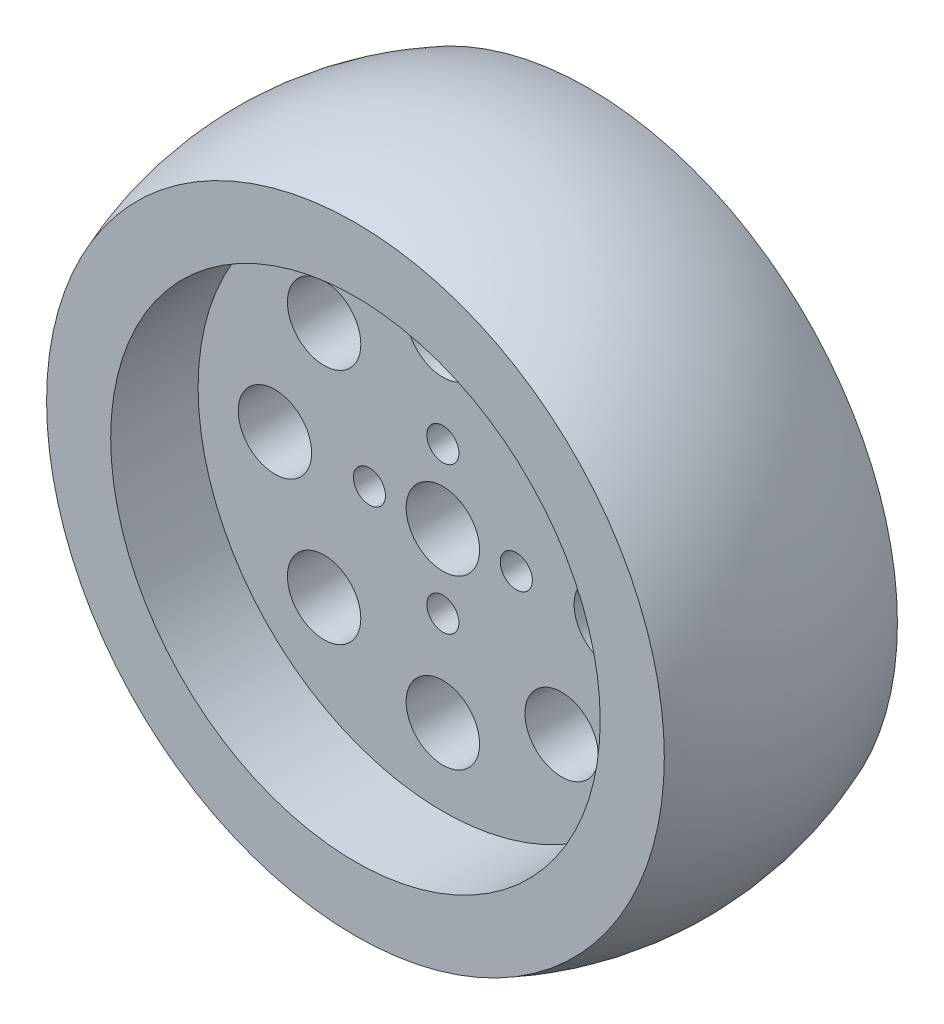
ISO-10303-21;
HEADER;
FILE_DESCRIPTION(('STEP AP214'),'2;1');
FILE_NAME('part.step','',(''),(''),'','','');
FILE_SCHEMA(('AUTOMOTIVE_DESIGN { 1 0 10303 214 1 1 1 1 }'));
ENDSEC;
DATA;
#1=APPLICATION_CONTEXT('core data for automotive mechanical design processes');
#2=APPLICATION_PROTOCOL_DEFINITION('international standard','automotive_design',2000,#1);
#3=PRODUCT_CONTEXT('',#1,'mechanical');
#4=PRODUCT('Part','Part','',(#3));
#5=PRODUCT_RELATED_PRODUCT_CATEGORY('part','',(#4));
#6=PRODUCT_DEFINITION_FORMATION('','',#4);
#7=PRODUCT_DEFINITION_CONTEXT('part definition',#1,'design');
#8=PRODUCT_DEFINITION('design','',#6,#7);
#9=PRODUCT_DEFINITION_SHAPE('','',#8);
#10=(LENGTH_UNIT() NAMED_UNIT(*) SI_UNIT(.MILLI.,.METRE.));
#11=(NAMED_UNIT(*) PLANE_ANGLE_UNIT() SI_UNIT($,.RADIAN.));
#12=(NAMED_UNIT(*) SI_UNIT($,.STERADIAN.) SOLID_ANGLE_UNIT());
#13=UNCERTAINTY_MEASURE_WITH_UNIT(LENGTH_MEASURE(1.E-05),#10,'distance_accuracy_value','');
#14=(GEOMETRIC_REPRESENTATION_CONTEXT(3) GLOBAL_UNCERTAINTY_ASSIGNED_CONTEXT((#13)) GLOBAL_UNIT_ASSIGNED_CONTEXT((#10,
#11,#12)) REPRESENTATION_CONTEXT('',''));
#15=CARTESIAN_POINT('',(0.,0.,0.));
#16=DIRECTION('',(0.,0.,1.));
#17=DIRECTION('',(1.,0.,0.));
#18=AXIS2_PLACEMENT_3D('',#15,#16,#17);
#19=CARTESIAN_POINT('',(0.,0.,2.159));
#20=DIRECTION('',(0.,0.,1.));
#21=DIRECTION('',(1.,0.,0.));
#22=AXIS2_PLACEMENT_3D('',#19,#20,#21);
#23=PLANE('',#22);
#24=CARTESIAN_POINT('',(0.,0.,2.159));
#25=DIRECTION('',(0.,0.,1.));
#26=DIRECTION('',(1.,0.,0.));
#27=AXIS2_PLACEMENT_3D('',#24,#25,#26);
#28=CIRCLE('',#27,26.67);
#29=CARTESIAN_POINT('',(26.67,0.,2.159));
#30=VERTEX_POINT('',#29);
#31=EDGE_CURVE('E42',#30,#30,#28,.T.);
#32=ORIENTED_EDGE('',*,*,#31,.F.);
#33=EDGE_LOOP('',(#32));
#34=FACE_BOUND('',#33,.T.);
#35=CARTESIAN_POINT('',(0.,0.,2.159));
#36=DIRECTION('',(0.,0.,-1.));
#37=DIRECTION('',(-1.,0.,0.));
#38=AXIS2_PLACEMENT_3D('',#35,#36,#37);
#39=CIRCLE('',#38,33.655);
#40=CARTESIAN_POINT('',(-33.655,0.,2.159));
#41=VERTEX_POINT('',#40);
#42=EDGE_CURVE('E49',#41,#41,#39,.T.);
#43=ORIENTED_EDGE('',*,*,#42,.F.);
#44=EDGE_LOOP('',(#43));
#45=FACE_BOUND('',#44,.T.);
#46=ADVANCED_FACE('F29',(#34,#45),#23,.T.);
#47=CARTESIAN_POINT('',(0.,0.,-7.366));
#48=DIRECTION('',(0.,0.,1.));
#49=DIRECTION('',(1.,0.,0.));
#50=AXIS2_PLACEMENT_3D('',#47,#48,#49);
#51=PLANE('',#50);
#52=CARTESIAN_POINT('',(-12.9400540957138,12.9400540957138,-7.366));
#53=DIRECTION('',(0.,0.,1.));
#54=DIRECTION('',(1.,0.,0.));
#55=AXIS2_PLACEMENT_3D('',#52,#53,#54);
#56=CIRCLE('',#55,4.);
#57=CARTESIAN_POINT('',(-8.94005409571382,12.9400540957138,-7.366));
#58=VERTEX_POINT('',#57);
#59=EDGE_CURVE('E102',#58,#58,#56,.T.);
#60=ORIENTED_EDGE('',*,*,#59,.F.);
#61=EDGE_LOOP('',(#60));
#62=FACE_BOUND('',#61,.T.);
#63=CARTESIAN_POINT('',(-12.9400540957138,-12.9400540957138,-7.366));
#64=DIRECTION('',(0.,0.,1.));
#65=DIRECTION('',(1.,0.,0.));
#66=AXIS2_PLACEMENT_3D('',#63,#64,#65);
#67=CIRCLE('',#66,4.);
#68=CARTESIAN_POINT('',(-8.94005409571382,-12.9400540957138,-7.366));
#69=VERTEX_POINT('',#68);
#70=EDGE_CURVE('E92',#69,#69,#67,.T.);
#71=ORIENTED_EDGE('',*,*,#70,.F.);
#72=EDGE_LOOP('',(#71));
#73=FACE_BOUND('',#72,.T.);
#74=CARTESIAN_POINT('',(12.9400540957138,-12.9400540957138,-7.366));
#75=DIRECTION('',(0.,0.,1.));
#76=DIRECTION('',(1.,0.,0.));
#77=AXIS2_PLACEMENT_3D('',#74,#75,#76);
#78=CIRCLE('',#77,4.);
#79=CARTESIAN_POINT('',(16.9400540957138,-12.9400540957138,-7.366));
#80=VERTEX_POINT('',#79);
#81=EDGE_CURVE('E89',#80,#80,#78,.T.);
#82=ORIENTED_EDGE('',*,*,#81,.F.);
#83=EDGE_LOOP('',(#82));
#84=FACE_BOUND('',#83,.T.);
#85=CARTESIAN_POINT('',(12.9400540957138,12.9400540957138,-7.366));
#86=DIRECTION('',(0.,0.,1.));
#87=DIRECTION('',(1.,0.,0.));
#88=AXIS2_PLACEMENT_3D('',#85,#86,#87);
#89=CIRCLE('',#88,4.);
#90=CARTESIAN_POINT('',(16.9400540957138,12.9400540957138,-7.366));
#91=VERTEX_POINT('',#90);
#92=EDGE_CURVE('E86',#91,#91,#89,.T.);
#93=ORIENTED_EDGE('',*,*,#92,.F.);
#94=EDGE_LOOP('',(#93));
#95=FACE_BOUND('',#94,.T.);
#96=CARTESIAN_POINT('',(-18.3,0.,-7.366));
#97=DIRECTION('',(0.,0.,1.));
#98=DIRECTION('',(1.,0.,0.));
#99=AXIS2_PLACEMENT_3D('',#96,#97,#98);
#100=CIRCLE('',#99,4.);
#101=CARTESIAN_POINT('',(-14.3,0.,-7.366));
#102=VERTEX_POINT('',#101);
#103=EDGE_CURVE('E82',#102,#102,#100,.T.);
#104=ORIENTED_EDGE('',*,*,#103,.F.);
#105=EDGE_LOOP('',(#104));
#106=FACE_BOUND('',#105,.T.);
#107=CARTESIAN_POINT('',(0.,-18.3,-7.366));
#108=DIRECTION('',(0.,0.,1.));
#109=DIRECTION('',(1.,0.,0.));
#110=AXIS2_PLACEMENT_3D('',#107,#108,#109);
#111=CIRCLE('',#110,4.);
#112=CARTESIAN_POINT('',(4.,-18.3,-7.366));
#113=VERTEX_POINT('',#112);
#114=EDGE_CURVE('E78',#113,#113,#111,.T.);
#115=ORIENTED_EDGE('',*,*,#114,.F.);
#116=EDGE_LOOP('',(#115));
#117=FACE_BOUND('',#116,.T.);
#118=CARTESIAN_POINT('',(18.3,0.,-7.366));
#119=DIRECTION('',(0.,0.,1.));
#120=DIRECTION('',(1.,0.,0.));
#121=AXIS2_PLACEMENT_3D('',#118,#119,#120);
#122=CIRCLE('',#121,4.);
#123=CARTESIAN_POINT('',(22.3,0.,-7.366));
#124=VERTEX_POINT('',#123);
#125=EDGE_CURVE('E74',#124,#124,#122,.T.);
#126=ORIENTED_EDGE('',*,*,#125,.F.);
#127=EDGE_LOOP('',(#126));
#128=FACE_BOUND('',#127,.T.);
#129=CARTESIAN_POINT('',(0.,18.3,-7.366));
#130=DIRECTION('',(0.,0.,1.));
#131=DIRECTION('',(1.,0.,0.));
#132=AXIS2_PLACEMENT_3D('',#129,#130,#131);
#133=CIRCLE('',#132,4.);
#134=CARTESIAN_POINT('',(4.,18.3,-7.366));
#135=VERTEX_POINT('',#134);
#136=EDGE_CURVE('E70',#135,#135,#133,.T.);
#137=ORIENTED_EDGE('',*,*,#136,.F.);
#138=EDGE_LOOP('',(#137));
#139=FACE_BOUND('',#138,.T.);
#140=CARTESIAN_POINT('',(-8.,0.,-7.366));
#141=DIRECTION('',(0.,0.,1.));
#142=DIRECTION('',(1.,0.,0.));
#143=AXIS2_PLACEMENT_3D('',#140,#141,#142);
#144=CIRCLE('',#143,1.75);
#145=CARTESIAN_POINT('',(-6.25,0.,-7.366));
#146=VERTEX_POINT('',#145);
#147=EDGE_CURVE('E66',#146,#146,#144,.T.);
#148=ORIENTED_EDGE('',*,*,#147,.F.);
#149=EDGE_LOOP('',(#148));
#150=FACE_BOUND('',#149,.T.);
#151=CARTESIAN_POINT('',(0.,-8.,-7.366));
#152=DIRECTION('',(0.,0.,1.));
#153=DIRECTION('',(1.,0.,0.));
#154=AXIS2_PLACEMENT_3D('',#151,#152,#153);
#155=CIRCLE('',#154,1.75);
#156=CARTESIAN_POINT('',(1.75,-8.,-7.366));
#157=VERTEX_POINT('',#156);
#158=EDGE_CURVE('E62',#157,#157,#155,.T.);
#159=ORIENTED_EDGE('',*,*,#158,.F.);
#160=EDGE_LOOP('',(#159));
#161=FACE_BOUND('',#160,.T.);
#162=CARTESIAN_POINT('',(8.,0.,-7.366));
#163=DIRECTION('',(0.,0.,1.));
#164=DIRECTION('',(1.,0.,0.));
#165=AXIS2_PLACEMENT_3D('',#162,#163,#164);
#166=CIRCLE('',#165,1.75);
#167=CARTESIAN_POINT('',(9.75,0.,-7.366));
#168=VERTEX_POINT('',#167);
#169=EDGE_CURVE('E58',#168,#168,#166,.T.);
#170=ORIENTED_EDGE('',*,*,#169,.F.);
#171=EDGE_LOOP('',(#170));
#172=FACE_BOUND('',#171,.T.);
#173=CARTESIAN_POINT('',(0.,8.,-7.366));
#174=DIRECTION('',(0.,0.,1.));
#175=DIRECTION('',(1.,0.,0.));
#176=AXIS2_PLACEMENT_3D('',#173,#174,#175);
#177=CIRCLE('',#176,1.75);
#178=CARTESIAN_POINT('',(1.75,8.,-7.366));
#179=VERTEX_POINT('',#178);
#180=EDGE_CURVE('E54',#179,#179,#177,.T.);
#181=ORIENTED_EDGE('',*,*,#180,.F.);
#182=EDGE_LOOP('',(#181));
#183=FACE_BOUND('',#182,.T.);
#184=CARTESIAN_POINT('',(0.,0.,-7.366));
#185=DIRECTION('',(0.,0.,1.));
#186=DIRECTION('',(1.,0.,0.));
#187=AXIS2_PLACEMENT_3D('',#184,#185,#186);
#188=CIRCLE('',#187,4.);
#189=CARTESIAN_POINT('',(4.,0.,-7.366));
#190=VERTEX_POINT('',#189);
#191=EDGE_CURVE('E50',#190,#190,#188,.T.);
#192=ORIENTED_EDGE('',*,*,#191,.F.);
#193=EDGE_LOOP('',(#192));
#194=FACE_BOUND('',#193,.T.);
#195=CARTESIAN_POINT('',(0.,0.,-7.366));
#196=DIRECTION('',(0.,0.,1.));
#197=DIRECTION('',(1.,0.,0.));
#198=AXIS2_PLACEMENT_3D('',#195,#196,#197);
#199=CIRCLE('',#198,26.67);
#200=CARTESIAN_POINT('',(26.67,0.,-7.366));
#201=VERTEX_POINT('',#200);
#202=EDGE_CURVE('E10',#201,#201,#199,.T.);
#203=ORIENTED_EDGE('',*,*,#202,.T.);
#204=EDGE_LOOP('',(#203));
#205=FACE_BOUND('',#204,.T.);
#206=ADVANCED_FACE('F138',(#62,#73,#84,#95,#106,#117,#128,#139,#150,#161,#172,#183,#194,#205),
#51,.T.);
#207=CARTESIAN_POINT('',(0.,0.,-7.366));
#208=DIRECTION('',(0.,0.,1.));
#209=DIRECTION('',(1.,0.,0.));
#210=AXIS2_PLACEMENT_3D('',#207,#208,#209);
#211=CYLINDRICAL_SURFACE('',#210,26.67);
#212=ORIENTED_EDGE('',*,*,#202,.F.);
#213=EDGE_LOOP('',(#212));
#214=FACE_BOUND('',#213,.T.);
#215=ORIENTED_EDGE('',*,*,#31,.T.);
#216=EDGE_LOOP('',(#215));
#217=FACE_BOUND('',#216,.T.);
#218=ADVANCED_FACE('F31',(#214,#217),#211,.F.);
#219=CARTESIAN_POINT('',(0.,0.,-10.541));
#220=DIRECTION('',(0.,0.,-1.));
#221=DIRECTION('',(-1.,0.,0.));
#222=AXIS2_PLACEMENT_3D('',#219,#220,#221);
#223=DEGENERATE_TOROIDAL_SURFACE('',#222,1.8774674519895,34.2213613820355,.T.);
#224=CARTESIAN_POINT('',(0.,0.,-23.241));
#225=DIRECTION('',(0.,0.,-1.));
#226=DIRECTION('',(-1.,0.,0.));
#227=AXIS2_PLACEMENT_3D('',#224,#225,#226);
#228=CIRCLE('',#227,33.655);
#229=CARTESIAN_POINT('',(-33.655,0.,-23.241));
#230=VERTEX_POINT('',#229);
#231=EDGE_CURVE('E127',#230,#230,#228,.T.);
#232=ORIENTED_EDGE('',*,*,#231,.F.);
#233=EDGE_LOOP('',(#232));
#234=FACE_BOUND('',#233,.T.);
#235=ORIENTED_EDGE('',*,*,#42,.T.);
#236=EDGE_LOOP('',(#235));
#237=FACE_BOUND('',#236,.T.);
#238=ADVANCED_FACE('F142',(#234,#237),#223,.T.);
#239=CARTESIAN_POINT('',(0.,0.,-13.716));
#240=DIRECTION('',(0.,0.,-1.));
#241=DIRECTION('',(-1.,0.,0.));
#242=AXIS2_PLACEMENT_3D('',#239,#240,#241);
#243=PLANE('',#242);
#244=CARTESIAN_POINT('',(-12.9400540957138,12.9400540957138,-13.716));
#245=DIRECTION('',(0.,0.,-1.));
#246=DIRECTION('',(-1.,0.,0.));
#247=AXIS2_PLACEMENT_3D('',#244,#245,#246);
#248=CIRCLE('',#247,4.);
#249=CARTESIAN_POINT('',(-16.9400540957138,12.9400540957138,-13.716));
#250=VERTEX_POINT('',#249);
#251=EDGE_CURVE('E33',#250,#250,#248,.T.);
#252=ORIENTED_EDGE('',*,*,#251,.F.);
#253=EDGE_LOOP('',(#252));
#254=FACE_BOUND('',#253,.T.);
#255=CARTESIAN_POINT('',(-12.9400540957138,-12.9400540957138,-13.716));
#256=DIRECTION('',(0.,0.,-1.));
#257=DIRECTION('',(-1.,0.,0.));
#258=AXIS2_PLACEMENT_3D('',#255,#256,#257);
#259=CIRCLE('',#258,4.);
#260=CARTESIAN_POINT('',(-16.9400540957138,-12.9400540957138,-13.716));
#261=VERTEX_POINT('',#260);
#262=EDGE_CURVE('E90',#261,#261,#259,.T.);
#263=ORIENTED_EDGE('',*,*,#262,.F.);
#264=EDGE_LOOP('',(#263));
#265=FACE_BOUND('',#264,.T.);
#266=CARTESIAN_POINT('',(12.9400540957138,-12.9400540957138,-13.716));
#267=DIRECTION('',(0.,0.,-1.));
#268=DIRECTION('',(-1.,0.,0.));
#269=AXIS2_PLACEMENT_3D('',#266,#267,#268);
#270=CIRCLE('',#269,4.);
#271=CARTESIAN_POINT('',(8.94005409571382,-12.9400540957138,-13.716));
#272=VERTEX_POINT('',#271);
#273=EDGE_CURVE('E87',#272,#272,#270,.T.);
#274=ORIENTED_EDGE('',*,*,#273,.F.);
#275=EDGE_LOOP('',(#274));
#276=FACE_BOUND('',#275,.T.);
#277=CARTESIAN_POINT('',(12.9400540957138,12.9400540957138,-13.716));
#278=DIRECTION('',(0.,0.,-1.));
#279=DIRECTION('',(-1.,0.,0.));
#280=AXIS2_PLACEMENT_3D('',#277,#278,#279);
#281=CIRCLE('',#280,4.);
#282=CARTESIAN_POINT('',(8.94005409571382,12.9400540957138,-13.716));
#283=VERTEX_POINT('',#282);
#284=EDGE_CURVE('E83',#283,#283,#281,.T.);
#285=ORIENTED_EDGE('',*,*,#284,.F.);
#286=EDGE_LOOP('',(#285));
#287=FACE_BOUND('',#286,.T.);
#288=CARTESIAN_POINT('',(-18.3,0.,-13.716));
#289=DIRECTION('',(0.,0.,-1.));
#290=DIRECTION('',(-1.,0.,0.));
#291=AXIS2_PLACEMENT_3D('',#288,#289,#290);
#292=CIRCLE('',#291,4.);
#293=CARTESIAN_POINT('',(-22.3,0.,-13.716));
#294=VERTEX_POINT('',#293);
#295=EDGE_CURVE('E79',#294,#294,#292,.T.);
#296=ORIENTED_EDGE('',*,*,#295,.F.);
#297=EDGE_LOOP('',(#296));
#298=FACE_BOUND('',#297,.T.);
#299=CARTESIAN_POINT('',(0.,-18.3,-13.716));
#300=DIRECTION('',(0.,0.,-1.));
#301=DIRECTION('',(-1.,0.,0.));
#302=AXIS2_PLACEMENT_3D('',#299,#300,#301);
#303=CIRCLE('',#302,4.);
#304=CARTESIAN_POINT('',(-4.,-18.3,-13.716));
#305=VERTEX_POINT('',#304);
#306=EDGE_CURVE('E75',#305,#305,#303,.T.);
#307=ORIENTED_EDGE('',*,*,#306,.F.);
#308=EDGE_LOOP('',(#307));
#309=FACE_BOUND('',#308,.T.);
#310=CARTESIAN_POINT('',(18.3,0.,-13.716));
#311=DIRECTION('',(0.,0.,-1.));
#312=DIRECTION('',(-1.,0.,0.));
#313=AXIS2_PLACEMENT_3D('',#310,#311,#312);
#314=CIRCLE('',#313,4.);
#315=CARTESIAN_POINT('',(14.3,0.,-13.716));
#316=VERTEX_POINT('',#315);
#317=EDGE_CURVE('E71',#316,#316,#314,.T.);
#318=ORIENTED_EDGE('',*,*,#317,.F.);
#319=EDGE_LOOP('',(#318));
#320=FACE_BOUND('',#319,.T.);
#321=CARTESIAN_POINT('',(0.,18.3,-13.716));
#322=DIRECTION('',(0.,0.,-1.));
#323=DIRECTION('',(-1.,0.,0.));
#324=AXIS2_PLACEMENT_3D('',#321,#322,#323);
#325=CIRCLE('',#324,4.);
#326=CARTESIAN_POINT('',(-4.,18.3,-13.716));
#327=VERTEX_POINT('',#326);
#328=EDGE_CURVE('E67',#327,#327,#325,.T.);
#329=ORIENTED_EDGE('',*,*,#328,.F.);
#330=EDGE_LOOP('',(#329));
#331=FACE_BOUND('',#330,.T.);
#332=CARTESIAN_POINT('',(-8.,0.,-13.716));
#333=DIRECTION('',(0.,0.,-1.));
#334=DIRECTION('',(-1.,0.,0.));
#335=AXIS2_PLACEMENT_3D('',#332,#333,#334);
#336=CIRCLE('',#335,1.75);
#337=CARTESIAN_POINT('',(-9.75,0.,-13.716));
#338=VERTEX_POINT('',#337);
#339=EDGE_CURVE('E63',#338,#338,#336,.T.);
#340=ORIENTED_EDGE('',*,*,#339,.F.);
#341=EDGE_LOOP('',(#340));
#342=FACE_BOUND('',#341,.T.);
#343=CARTESIAN_POINT('',(0.,-8.,-13.716));
#344=DIRECTION('',(0.,0.,-1.));
#345=DIRECTION('',(-1.,0.,0.));
#346=AXIS2_PLACEMENT_3D('',#343,#344,#345);
#347=CIRCLE('',#346,1.75);
#348=CARTESIAN_POINT('',(-1.75,-8.,-13.716));
#349=VERTEX_POINT('',#348);
#350=EDGE_CURVE('E59',#349,#349,#347,.T.);
#351=ORIENTED_EDGE('',*,*,#350,.F.);
#352=EDGE_LOOP('',(#351));
#353=FACE_BOUND('',#352,.T.);
#354=CARTESIAN_POINT('',(8.,0.,-13.716));
#355=DIRECTION('',(0.,0.,-1.));
#356=DIRECTION('',(-1.,0.,0.));
#357=AXIS2_PLACEMENT_3D('',#354,#355,#356);
#358=CIRCLE('',#357,1.75);
#359=CARTESIAN_POINT('',(6.25,0.,-13.716));
#360=VERTEX_POINT('',#359);
#361=EDGE_CURVE('E55',#360,#360,#358,.T.);
#362=ORIENTED_EDGE('',*,*,#361,.F.);
#363=EDGE_LOOP('',(#362));
#364=FACE_BOUND('',#363,.T.);
#365=CARTESIAN_POINT('',(0.,8.,-13.716));
#366=DIRECTION('',(0.,0.,-1.));
#367=DIRECTION('',(-1.,0.,0.));
#368=AXIS2_PLACEMENT_3D('',#365,#366,#367);
#369=CIRCLE('',#368,1.75);
#370=CARTESIAN_POINT('',(-1.75,8.,-13.716));
#371=VERTEX_POINT('',#370);
#372=EDGE_CURVE('E51',#371,#371,#369,.T.);
#373=ORIENTED_EDGE('',*,*,#372,.F.);
#374=EDGE_LOOP('',(#373));
#375=FACE_BOUND('',#374,.T.);
#376=CARTESIAN_POINT('',(0.,0.,-13.716));
#377=DIRECTION('',(0.,0.,-1.));
#378=DIRECTION('',(-1.,0.,0.));
#379=AXIS2_PLACEMENT_3D('',#376,#377,#378);
#380=CIRCLE('',#379,4.);
#381=CARTESIAN_POINT('',(-4.,0.,-13.716));
#382=VERTEX_POINT('',#381);
#383=EDGE_CURVE('E46',#382,#382,#380,.T.);
#384=ORIENTED_EDGE('',*,*,#383,.F.);
#385=EDGE_LOOP('',(#384));
#386=FACE_BOUND('',#385,.T.);
#387=CARTESIAN_POINT('',(0.,0.,-13.716));
#388=DIRECTION('',(0.,0.,-1.));
#389=DIRECTION('',(-1.,0.,0.));
#390=AXIS2_PLACEMENT_3D('',#387,#388,#389);
#391=CIRCLE('',#390,26.67);
#392=CARTESIAN_POINT('',(-26.67,0.,-13.716));
#393=VERTEX_POINT('',#392);
#394=EDGE_CURVE('E37',#393,#393,#391,.T.);
#395=ORIENTED_EDGE('',*,*,#394,.T.);
#396=EDGE_LOOP('',(#395));
#397=FACE_BOUND('',#396,.T.);
#398=ADVANCED_FACE('F144',(#254,#265,#276,#287,#298,#309,#320,#331,#342,#353,#364,#375,#386,
#397),#243,.T.);
#399=CARTESIAN_POINT('',(0.,0.,-13.716));
#400=DIRECTION('',(0.,0.,-1.));
#401=DIRECTION('',(-1.,0.,0.));
#402=AXIS2_PLACEMENT_3D('',#399,#400,#401);
#403=CYLINDRICAL_SURFACE('',#402,26.67);
#404=ORIENTED_EDGE('',*,*,#394,.F.);
#405=EDGE_LOOP('',(#404));
#406=FACE_BOUND('',#405,.T.);
#407=CARTESIAN_POINT('',(0.,0.,-23.241));
#408=DIRECTION('',(0.,0.,-1.));
#409=DIRECTION('',(-1.,0.,0.));
#410=AXIS2_PLACEMENT_3D('',#407,#408,#409);
#411=CIRCLE('',#410,26.67);
#412=CARTESIAN_POINT('',(-26.67,0.,-23.241));
#413=VERTEX_POINT('',#412);
#414=EDGE_CURVE('E130',#413,#413,#411,.T.);
#415=ORIENTED_EDGE('',*,*,#414,.T.);
#416=EDGE_LOOP('',(#415));
#417=FACE_BOUND('',#416,.T.);
#418=ADVANCED_FACE('F151',(#406,#417),#403,.F.);
#419=CARTESIAN_POINT('',(0.,0.,-23.241));
#420=DIRECTION('',(0.,0.,-1.));
#421=DIRECTION('',(-1.,0.,0.));
#422=AXIS2_PLACEMENT_3D('',#419,#420,#421);
#423=PLANE('',#422);
#424=ORIENTED_EDGE('',*,*,#414,.F.);
#425=EDGE_LOOP('',(#424));
#426=FACE_BOUND('',#425,.T.);
#427=ORIENTED_EDGE('',*,*,#231,.T.);
#428=EDGE_LOOP('',(#427));
#429=FACE_BOUND('',#428,.T.);
#430=ADVANCED_FACE('F160',(#426,#429),#423,.T.);
#431=CARTESIAN_POINT('',(0.,0.,-23.241));
#432=DIRECTION('',(0.,0.,1.));
#433=DIRECTION('',(1.,0.,0.));
#434=AXIS2_PLACEMENT_3D('',#431,#432,#433);
#435=CYLINDRICAL_SURFACE('',#434,4.);
#436=ORIENTED_EDGE('',*,*,#383,.T.);
#437=EDGE_LOOP('',(#436));
#438=FACE_BOUND('',#437,.T.);
#439=ORIENTED_EDGE('',*,*,#191,.T.);
#440=EDGE_LOOP('',(#439));
#441=FACE_BOUND('',#440,.T.);
#442=ADVANCED_FACE('F158',(#438,#441),#435,.F.);
#443=CARTESIAN_POINT('',(0.,8.,-23.241));
#444=DIRECTION('',(0.,0.,1.));
#445=DIRECTION('',(1.,0.,0.));
#446=AXIS2_PLACEMENT_3D('',#443,#444,#445);
#447=CYLINDRICAL_SURFACE('',#446,1.75);
#448=ORIENTED_EDGE('',*,*,#372,.T.);
#449=EDGE_LOOP('',(#448));
#450=FACE_BOUND('',#449,.T.);
#451=ORIENTED_EDGE('',*,*,#180,.T.);
#452=EDGE_LOOP('',(#451));
#453=FACE_BOUND('',#452,.T.);
#454=ADVANCED_FACE('F197',(#450,#453),#447,.F.);
#455=CARTESIAN_POINT('',(8.,0.,-23.241));
#456=DIRECTION('',(0.,0.,1.));
#457=DIRECTION('',(1.,0.,0.));
#458=AXIS2_PLACEMENT_3D('',#455,#456,#457);
#459=CYLINDRICAL_SURFACE('',#458,1.75);
#460=ORIENTED_EDGE('',*,*,#361,.T.);
#461=EDGE_LOOP('',(#460));
#462=FACE_BOUND('',#461,.T.);
#463=ORIENTED_EDGE('',*,*,#169,.T.);
#464=EDGE_LOOP('',(#463));
#465=FACE_BOUND('',#464,.T.);
#466=ADVANCED_FACE('F202',(#462,#465),#459,.F.);
#467=CARTESIAN_POINT('',(0.,-8.,-23.241));
#468=DIRECTION('',(0.,0.,1.));
#469=DIRECTION('',(1.,0.,0.));
#470=AXIS2_PLACEMENT_3D('',#467,#468,#469);
#471=CYLINDRICAL_SURFACE('',#470,1.75);
#472=ORIENTED_EDGE('',*,*,#350,.T.);
#473=EDGE_LOOP('',(#472));
#474=FACE_BOUND('',#473,.T.);
#475=ORIENTED_EDGE('',*,*,#158,.T.);
#476=EDGE_LOOP('',(#475));
#477=FACE_BOUND('',#476,.T.);
#478=ADVANCED_FACE('F214',(#474,#477),#471,.F.);
#479=CARTESIAN_POINT('',(-8.,0.,-23.241));
#480=DIRECTION('',(0.,0.,1.));
#481=DIRECTION('',(1.,0.,0.));
#482=AXIS2_PLACEMENT_3D('',#479,#480,#481);
#483=CYLINDRICAL_SURFACE('',#482,1.75);
#484=ORIENTED_EDGE('',*,*,#339,.T.);
#485=EDGE_LOOP('',(#484));
#486=FACE_BOUND('',#485,.T.);
#487=ORIENTED_EDGE('',*,*,#147,.T.);
#488=EDGE_LOOP('',(#487));
#489=FACE_BOUND('',#488,.T.);
#490=ADVANCED_FACE('F221',(#486,#489),#483,.F.);
#491=CARTESIAN_POINT('',(0.,18.3,-23.241));
#492=DIRECTION('',(0.,0.,1.));
#493=DIRECTION('',(1.,0.,0.));
#494=AXIS2_PLACEMENT_3D('',#491,#492,#493);
#495=CYLINDRICAL_SURFACE('',#494,4.);
#496=ORIENTED_EDGE('',*,*,#328,.T.);
#497=EDGE_LOOP('',(#496));
#498=FACE_BOUND('',#497,.T.);
#499=ORIENTED_EDGE('',*,*,#136,.T.);
#500=EDGE_LOOP('',(#499));
#501=FACE_BOUND('',#500,.T.);
#502=ADVANCED_FACE('F225',(#498,#501),#495,.F.);
#503=CARTESIAN_POINT('',(18.3,0.,-23.241));
#504=DIRECTION('',(0.,0.,1.));
#505=DIRECTION('',(1.,0.,0.));
#506=AXIS2_PLACEMENT_3D('',#503,#504,#505);
#507=CYLINDRICAL_SURFACE('',#506,4.);
#508=ORIENTED_EDGE('',*,*,#317,.T.);
#509=EDGE_LOOP('',(#508));
#510=FACE_BOUND('',#509,.T.);
#511=ORIENTED_EDGE('',*,*,#125,.T.);
#512=EDGE_LOOP('',(#511));
#513=FACE_BOUND('',#512,.T.);
#514=ADVANCED_FACE('F229',(#510,#513),#507,.F.);
#515=CARTESIAN_POINT('',(0.,-18.3,-23.241));
#516=DIRECTION('',(0.,0.,1.));
#517=DIRECTION('',(1.,0.,0.));
#518=AXIS2_PLACEMENT_3D('',#515,#516,#517);
#519=CYLINDRICAL_SURFACE('',#518,4.);
#520=ORIENTED_EDGE('',*,*,#306,.T.);
#521=EDGE_LOOP('',(#520));
#522=FACE_BOUND('',#521,.T.);
#523=ORIENTED_EDGE('',*,*,#114,.T.);
#524=EDGE_LOOP('',(#523));
#525=FACE_BOUND('',#524,.T.);
#526=ADVANCED_FACE('F233',(#522,#525),#519,.F.);
#527=CARTESIAN_POINT('',(-18.3,0.,-23.241));
#528=DIRECTION('',(0.,0.,1.));
#529=DIRECTION('',(1.,0.,0.));
#530=AXIS2_PLACEMENT_3D('',#527,#528,#529);
#531=CYLINDRICAL_SURFACE('',#530,4.);
#532=ORIENTED_EDGE('',*,*,#295,.T.);
#533=EDGE_LOOP('',(#532));
#534=FACE_BOUND('',#533,.T.);
#535=ORIENTED_EDGE('',*,*,#103,.T.);
#536=EDGE_LOOP('',(#535));
#537=FACE_BOUND('',#536,.T.);
#538=ADVANCED_FACE('F237',(#534,#537),#531,.F.);
#539=CARTESIAN_POINT('',(12.9400540957138,12.9400540957138,-23.241));
#540=DIRECTION('',(0.,0.,1.));
#541=DIRECTION('',(1.,0.,0.));
#542=AXIS2_PLACEMENT_3D('',#539,#540,#541);
#543=CYLINDRICAL_SURFACE('',#542,4.);
#544=ORIENTED_EDGE('',*,*,#284,.T.);
#545=EDGE_LOOP('',(#544));
#546=FACE_BOUND('',#545,.T.);
#547=ORIENTED_EDGE('',*,*,#92,.T.);
#548=EDGE_LOOP('',(#547));
#549=FACE_BOUND('',#548,.T.);
#550=ADVANCED_FACE('F241',(#546,#549),#543,.F.);
#551=CARTESIAN_POINT('',(12.9400540957138,-12.9400540957138,-23.241));
#552=DIRECTION('',(0.,0.,1.));
#553=DIRECTION('',(1.,0.,0.));
#554=AXIS2_PLACEMENT_3D('',#551,#552,#553);
#555=CYLINDRICAL_SURFACE('',#554,4.);
#556=ORIENTED_EDGE('',*,*,#273,.T.);
#557=EDGE_LOOP('',(#556));
#558=FACE_BOUND('',#557,.T.);
#559=ORIENTED_EDGE('',*,*,#81,.T.);
#560=EDGE_LOOP('',(#559));
#561=FACE_BOUND('',#560,.T.);
#562=ADVANCED_FACE('F245',(#558,#561),#555,.F.);
#563=CARTESIAN_POINT('',(-12.9400540957138,-12.9400540957138,-23.241));
#564=DIRECTION('',(0.,0.,1.));
#565=DIRECTION('',(1.,0.,0.));
#566=AXIS2_PLACEMENT_3D('',#563,#564,#565);
#567=CYLINDRICAL_SURFACE('',#566,4.);
#568=ORIENTED_EDGE('',*,*,#262,.T.);
#569=EDGE_LOOP('',(#568));
#570=FACE_BOUND('',#569,.T.);
#571=ORIENTED_EDGE('',*,*,#70,.T.);
#572=EDGE_LOOP('',(#571));
#573=FACE_BOUND('',#572,.T.);
#574=ADVANCED_FACE('F249',(#570,#573),#567,.F.);
#575=CARTESIAN_POINT('',(-12.9400540957138,12.9400540957138,-23.241));
#576=DIRECTION('',(0.,0.,1.));
#577=DIRECTION('',(1.,0.,0.));
#578=AXIS2_PLACEMENT_3D('',#575,#576,#577);
#579=CYLINDRICAL_SURFACE('',#578,4.);
#580=ORIENTED_EDGE('',*,*,#251,.T.);
#581=EDGE_LOOP('',(#580));
#582=FACE_BOUND('',#581,.T.);
#583=ORIENTED_EDGE('',*,*,#59,.T.);
#584=EDGE_LOOP('',(#583));
#585=FACE_BOUND('',#584,.T.);
#586=ADVANCED_FACE('F253',(#582,#585),#579,.F.);
#587=CLOSED_SHELL('',(#46,#206,#218,#238,#398,#418,#430,#442,#454,#466,#478,#490,#502,#514,#526,
#538,#550,#562,#574,#586));
#588=MANIFOLD_SOLID_BREP('B2',#587);
#589=ADVANCED_BREP_SHAPE_REPRESENTATION('',(#18,#588),#14);
#590=SHAPE_DEFINITION_REPRESENTATION(#9,#589);
ENDSEC;
END-ISO-10303-21;
